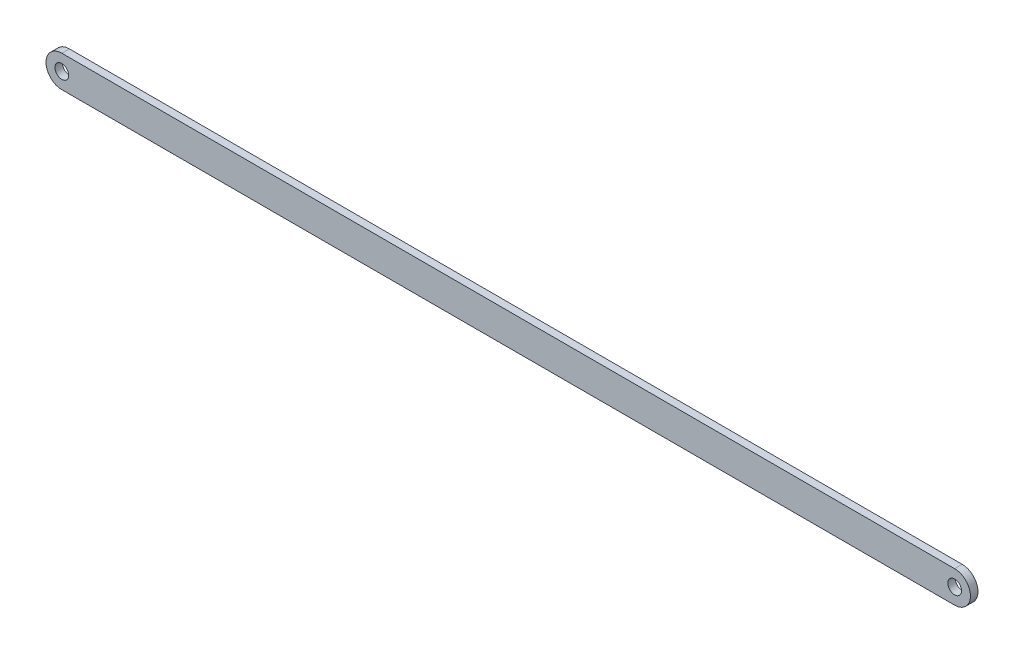
ISO-10303-21;
HEADER;
FILE_DESCRIPTION(('STEP AP214'),'2;1');
FILE_NAME('part.step','',(''),(''),'','','');
FILE_SCHEMA(('AUTOMOTIVE_DESIGN { 1 0 10303 214 1 1 1 1 }'));
ENDSEC;
DATA;
#1=APPLICATION_CONTEXT('core data for automotive mechanical design processes');
#2=APPLICATION_PROTOCOL_DEFINITION('international standard','automotive_design',2000,#1);
#3=PRODUCT_CONTEXT('',#1,'mechanical');
#4=PRODUCT('Part','Part','',(#3));
#5=PRODUCT_RELATED_PRODUCT_CATEGORY('part','',(#4));
#6=PRODUCT_DEFINITION_FORMATION('','',#4);
#7=PRODUCT_DEFINITION_CONTEXT('part definition',#1,'design');
#8=PRODUCT_DEFINITION('design','',#6,#7);
#9=PRODUCT_DEFINITION_SHAPE('','',#8);
#10=(LENGTH_UNIT() NAMED_UNIT(*) SI_UNIT(.MILLI.,.METRE.));
#11=(NAMED_UNIT(*) PLANE_ANGLE_UNIT() SI_UNIT($,.RADIAN.));
#12=(NAMED_UNIT(*) SI_UNIT($,.STERADIAN.) SOLID_ANGLE_UNIT());
#13=UNCERTAINTY_MEASURE_WITH_UNIT(LENGTH_MEASURE(1.E-05),#10,'distance_accuracy_value','');
#14=(GEOMETRIC_REPRESENTATION_CONTEXT(3) GLOBAL_UNCERTAINTY_ASSIGNED_CONTEXT((#13)) GLOBAL_UNIT_ASSIGNED_CONTEXT((#10,
#11,#12)) REPRESENTATION_CONTEXT('',''));
#15=CARTESIAN_POINT('',(0.,0.,0.));
#16=DIRECTION('',(0.,0.,1.));
#17=DIRECTION('',(1.,0.,0.));
#18=AXIS2_PLACEMENT_3D('',#15,#16,#17);
#19=CARTESIAN_POINT('',(-325.,0.,2.75));
#20=DIRECTION('',(0.,0.,1.));
#21=DIRECTION('',(1.,0.,0.));
#22=AXIS2_PLACEMENT_3D('',#19,#20,#21);
#23=PLANE('',#22);
#24=CARTESIAN_POINT('',(-325.,0.,2.75));
#25=DIRECTION('',(0.,0.,1.));
#26=DIRECTION('',(1.,0.,0.));
#27=AXIS2_PLACEMENT_3D('',#24,#25,#26);
#28=CIRCLE('',#27,4.99999999999999);
#29=CARTESIAN_POINT('',(-320.,0.,2.75));
#30=VERTEX_POINT('',#29);
#31=EDGE_CURVE('E112',#30,#30,#28,.T.);
#32=ORIENTED_EDGE('',*,*,#31,.F.);
#33=EDGE_LOOP('',(#32));
#34=FACE_BOUND('',#33,.T.);
#35=CARTESIAN_POINT('',(-325.,0.,2.75));
#36=DIRECTION('',(0.,0.,1.));
#37=DIRECTION('',(1.,0.,0.));
#38=AXIS2_PLACEMENT_3D('',#35,#36,#37);
#39=CIRCLE('',#38,11.5);
#40=CARTESIAN_POINT('',(-325.,11.5,2.75));
#41=VERTEX_POINT('',#40);
#42=CARTESIAN_POINT('',(-325.,-11.5,2.75));
#43=VERTEX_POINT('',#42);
#44=EDGE_CURVE('E92',#41,#43,#39,.T.);
#45=ORIENTED_EDGE('',*,*,#44,.T.);
#46=DIRECTION('',(1.,0.,0.));
#47=VECTOR('',#46,1.);
#48=CARTESIAN_POINT('',(-325.,-11.5,2.75));
#49=LINE('',#48,#47);
#50=CARTESIAN_POINT('',(325.,-11.5,2.75));
#51=VERTEX_POINT('',#50);
#52=EDGE_CURVE('E87',#43,#51,#49,.T.);
#53=ORIENTED_EDGE('',*,*,#52,.T.);
#54=CARTESIAN_POINT('',(325.,0.,2.75));
#55=DIRECTION('',(0.,0.,1.));
#56=DIRECTION('',(1.,0.,0.));
#57=AXIS2_PLACEMENT_3D('',#54,#55,#56);
#58=CIRCLE('',#57,11.5);
#59=CARTESIAN_POINT('',(325.,11.5,2.75));
#60=VERTEX_POINT('',#59);
#61=EDGE_CURVE('E90',#51,#60,#58,.T.);
#62=ORIENTED_EDGE('',*,*,#61,.T.);
#63=DIRECTION('',(-1.,0.,0.));
#64=VECTOR('',#63,1.);
#65=CARTESIAN_POINT('',(-325.,11.5,2.75));
#66=LINE('',#65,#64);
#67=EDGE_CURVE('E57',#60,#41,#66,.T.);
#68=ORIENTED_EDGE('',*,*,#67,.T.);
#69=EDGE_LOOP('',(#45,#53,#62,#68));
#70=FACE_BOUND('',#69,.T.);
#71=CARTESIAN_POINT('',(325.,0.,2.75));
#72=DIRECTION('',(0.,0.,1.));
#73=DIRECTION('',(1.,0.,0.));
#74=AXIS2_PLACEMENT_3D('',#71,#72,#73);
#75=CIRCLE('',#74,4.99999999999999);
#76=CARTESIAN_POINT('',(330.,0.,2.75));
#77=VERTEX_POINT('',#76);
#78=EDGE_CURVE('E134',#77,#77,#75,.T.);
#79=ORIENTED_EDGE('',*,*,#78,.F.);
#80=EDGE_LOOP('',(#79));
#81=FACE_BOUND('',#80,.T.);
#82=ADVANCED_FACE('F39',(#34,#70,#81),#23,.T.);
#83=CARTESIAN_POINT('',(-325.,0.,-2.75));
#84=DIRECTION('',(0.,0.,1.));
#85=DIRECTION('',(1.,0.,0.));
#86=AXIS2_PLACEMENT_3D('',#83,#84,#85);
#87=PLANE('',#86);
#88=CARTESIAN_POINT('',(-325.,0.,-2.75));
#89=DIRECTION('',(0.,0.,1.));
#90=DIRECTION('',(1.,0.,0.));
#91=AXIS2_PLACEMENT_3D('',#88,#89,#90);
#92=CIRCLE('',#91,11.5);
#93=CARTESIAN_POINT('',(-325.,11.5,-2.75));
#94=VERTEX_POINT('',#93);
#95=CARTESIAN_POINT('',(-325.,-11.5,-2.75));
#96=VERTEX_POINT('',#95);
#97=EDGE_CURVE('E108',#94,#96,#92,.T.);
#98=ORIENTED_EDGE('',*,*,#97,.F.);
#99=DIRECTION('',(-1.,0.,0.));
#100=VECTOR('',#99,1.);
#101=CARTESIAN_POINT('',(-325.,11.5,-2.75));
#102=LINE('',#101,#100);
#103=CARTESIAN_POINT('',(325.,11.5,-2.75));
#104=VERTEX_POINT('',#103);
#105=EDGE_CURVE('E80',#104,#94,#102,.T.);
#106=ORIENTED_EDGE('',*,*,#105,.F.);
#107=CARTESIAN_POINT('',(325.,0.,-2.75));
#108=DIRECTION('',(0.,0.,1.));
#109=DIRECTION('',(1.,0.,0.));
#110=AXIS2_PLACEMENT_3D('',#107,#108,#109);
#111=CIRCLE('',#110,11.5);
#112=CARTESIAN_POINT('',(325.,-11.5,-2.75));
#113=VERTEX_POINT('',#112);
#114=EDGE_CURVE('E74',#113,#104,#111,.T.);
#115=ORIENTED_EDGE('',*,*,#114,.F.);
#116=DIRECTION('',(1.,0.,0.));
#117=VECTOR('',#116,1.);
#118=CARTESIAN_POINT('',(-325.,-11.5,-2.75));
#119=LINE('',#118,#117);
#120=EDGE_CURVE('E97',#96,#113,#119,.T.);
#121=ORIENTED_EDGE('',*,*,#120,.F.);
#122=EDGE_LOOP('',(#98,#106,#115,#121));
#123=FACE_BOUND('',#122,.T.);
#124=CARTESIAN_POINT('',(-325.,0.,-2.75));
#125=DIRECTION('',(0.,0.,1.));
#126=DIRECTION('',(1.,0.,0.));
#127=AXIS2_PLACEMENT_3D('',#124,#125,#126);
#128=CIRCLE('',#127,4.99999999999999);
#129=CARTESIAN_POINT('',(-320.,0.,-2.75));
#130=VERTEX_POINT('',#129);
#131=EDGE_CURVE('E130',#130,#130,#128,.T.);
#132=ORIENTED_EDGE('',*,*,#131,.T.);
#133=EDGE_LOOP('',(#132));
#134=FACE_BOUND('',#133,.T.);
#135=CARTESIAN_POINT('',(325.,0.,-2.75));
#136=DIRECTION('',(0.,0.,1.));
#137=DIRECTION('',(1.,0.,0.));
#138=AXIS2_PLACEMENT_3D('',#135,#136,#137);
#139=CIRCLE('',#138,4.99999999999999);
#140=CARTESIAN_POINT('',(330.,0.,-2.75));
#141=VERTEX_POINT('',#140);
#142=EDGE_CURVE('E138',#141,#141,#139,.T.);
#143=ORIENTED_EDGE('',*,*,#142,.T.);
#144=EDGE_LOOP('',(#143));
#145=FACE_BOUND('',#144,.T.);
#146=ADVANCED_FACE('F125',(#123,#134,#145),#87,.F.);
#147=CARTESIAN_POINT('',(-325.,0.,2.75));
#148=DIRECTION('',(0.,0.,-1.));
#149=DIRECTION('',(-1.,0.,0.));
#150=AXIS2_PLACEMENT_3D('',#147,#148,#149);
#151=CYLINDRICAL_SURFACE('',#150,11.5);
#152=ORIENTED_EDGE('',*,*,#97,.T.);
#153=DIRECTION('',(0.,0.,-1.));
#154=VECTOR('',#153,1.);
#155=CARTESIAN_POINT('',(-325.,-11.5,2.75));
#156=LINE('',#155,#154);
#157=EDGE_CURVE('E11',#43,#96,#156,.T.);
#158=ORIENTED_EDGE('',*,*,#157,.F.);
#159=ORIENTED_EDGE('',*,*,#44,.F.);
#160=DIRECTION('',(0.,0.,-1.));
#161=VECTOR('',#160,1.);
#162=CARTESIAN_POINT('',(-325.,11.5,2.75));
#163=LINE('',#162,#161);
#164=EDGE_CURVE('E104',#41,#94,#163,.T.);
#165=ORIENTED_EDGE('',*,*,#164,.T.);
#166=EDGE_LOOP('',(#152,#158,#159,#165));
#167=FACE_BOUND('',#166,.T.);
#168=ADVANCED_FACE('F41',(#167),#151,.T.);
#169=CARTESIAN_POINT('',(-325.,-11.5,2.75));
#170=DIRECTION('',(0.,1.,0.));
#171=DIRECTION('',(0.,0.,1.));
#172=AXIS2_PLACEMENT_3D('',#169,#170,#171);
#173=PLANE('',#172);
#174=ORIENTED_EDGE('',*,*,#120,.T.);
#175=DIRECTION('',(0.,0.,-1.));
#176=VECTOR('',#175,1.);
#177=CARTESIAN_POINT('',(325.,-11.5,2.75));
#178=LINE('',#177,#176);
#179=EDGE_CURVE('E49',#51,#113,#178,.T.);
#180=ORIENTED_EDGE('',*,*,#179,.F.);
#181=ORIENTED_EDGE('',*,*,#52,.F.);
#182=ORIENTED_EDGE('',*,*,#157,.T.);
#183=EDGE_LOOP('',(#174,#180,#181,#182));
#184=FACE_BOUND('',#183,.T.);
#185=ADVANCED_FACE('F96',(#184),#173,.F.);
#186=CARTESIAN_POINT('',(325.,0.,2.75));
#187=DIRECTION('',(0.,0.,-1.));
#188=DIRECTION('',(-1.,0.,0.));
#189=AXIS2_PLACEMENT_3D('',#186,#187,#188);
#190=CYLINDRICAL_SURFACE('',#189,11.5);
#191=ORIENTED_EDGE('',*,*,#114,.T.);
#192=DIRECTION('',(0.,0.,-1.));
#193=VECTOR('',#192,1.);
#194=CARTESIAN_POINT('',(325.,11.5,2.75));
#195=LINE('',#194,#193);
#196=EDGE_CURVE('E99',#60,#104,#195,.T.);
#197=ORIENTED_EDGE('',*,*,#196,.F.);
#198=ORIENTED_EDGE('',*,*,#61,.F.);
#199=ORIENTED_EDGE('',*,*,#179,.T.);
#200=EDGE_LOOP('',(#191,#197,#198,#199));
#201=FACE_BOUND('',#200,.T.);
#202=ADVANCED_FACE('F100',(#201),#190,.T.);
#203=CARTESIAN_POINT('',(-325.,11.5,2.75));
#204=DIRECTION('',(0.,-1.,0.));
#205=DIRECTION('',(0.,0.,-1.));
#206=AXIS2_PLACEMENT_3D('',#203,#204,#205);
#207=PLANE('',#206);
#208=ORIENTED_EDGE('',*,*,#105,.T.);
#209=ORIENTED_EDGE('',*,*,#164,.F.);
#210=ORIENTED_EDGE('',*,*,#67,.F.);
#211=ORIENTED_EDGE('',*,*,#196,.T.);
#212=EDGE_LOOP('',(#208,#209,#210,#211));
#213=FACE_BOUND('',#212,.T.);
#214=ADVANCED_FACE('F122',(#213),#207,.F.);
#215=CARTESIAN_POINT('',(-325.,0.,2.75));
#216=DIRECTION('',(0.,0.,-1.));
#217=DIRECTION('',(-1.,0.,0.));
#218=AXIS2_PLACEMENT_3D('',#215,#216,#217);
#219=CYLINDRICAL_SURFACE('',#218,4.99999999999999);
#220=ORIENTED_EDGE('',*,*,#31,.T.);
#221=EDGE_LOOP('',(#220));
#222=FACE_BOUND('',#221,.T.);
#223=ORIENTED_EDGE('',*,*,#131,.F.);
#224=EDGE_LOOP('',(#223));
#225=FACE_BOUND('',#224,.T.);
#226=ADVANCED_FACE('F157',(#222,#225),#219,.F.);
#227=CARTESIAN_POINT('',(325.,0.,2.75));
#228=DIRECTION('',(0.,0.,-1.));
#229=DIRECTION('',(-1.,0.,0.));
#230=AXIS2_PLACEMENT_3D('',#227,#228,#229);
#231=CYLINDRICAL_SURFACE('',#230,4.99999999999999);
#232=ORIENTED_EDGE('',*,*,#78,.T.);
#233=EDGE_LOOP('',(#232));
#234=FACE_BOUND('',#233,.T.);
#235=ORIENTED_EDGE('',*,*,#142,.F.);
#236=EDGE_LOOP('',(#235));
#237=FACE_BOUND('',#236,.T.);
#238=ADVANCED_FACE('F146',(#234,#237),#231,.F.);
#239=CLOSED_SHELL('',(#82,#146,#168,#185,#202,#214,#226,#238));
#240=MANIFOLD_SOLID_BREP('B2',#239);
#241=ADVANCED_BREP_SHAPE_REPRESENTATION('',(#18,#240),#14);
#242=SHAPE_DEFINITION_REPRESENTATION(#9,#241);
ENDSEC;
END-ISO-10303-21;
